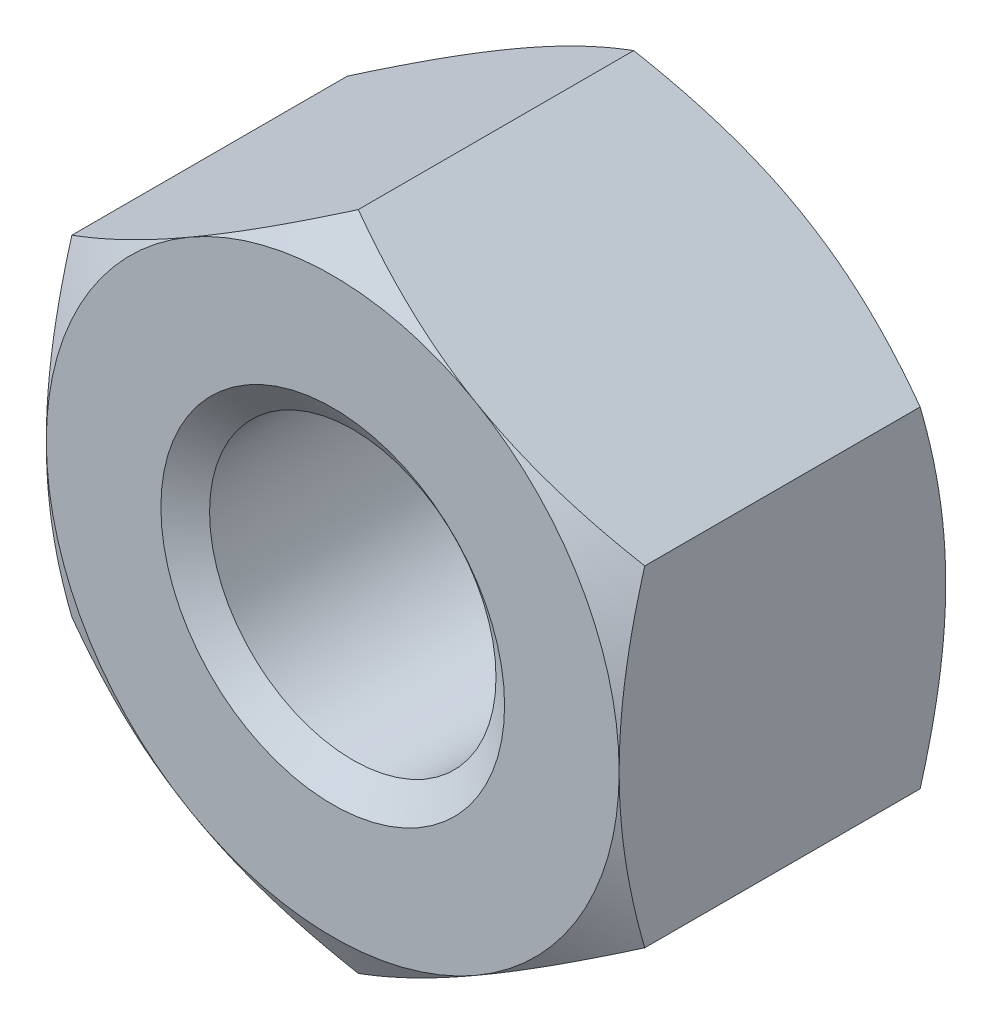
ISO-10303-21;
HEADER;
FILE_DESCRIPTION(('STEP AP214'),'2;1');
FILE_NAME('part.step','',(''),(''),'','','');
FILE_SCHEMA(('AUTOMOTIVE_DESIGN { 1 0 10303 214 1 1 1 1 }'));
ENDSEC;
DATA;
#1=APPLICATION_CONTEXT('core data for automotive mechanical design processes');
#2=APPLICATION_PROTOCOL_DEFINITION('international standard','automotive_design',2000,#1);
#3=PRODUCT_CONTEXT('',#1,'mechanical');
#4=PRODUCT('Part','Part','',(#3));
#5=PRODUCT_RELATED_PRODUCT_CATEGORY('part','',(#4));
#6=PRODUCT_DEFINITION_FORMATION('','',#4);
#7=PRODUCT_DEFINITION_CONTEXT('part definition',#1,'design');
#8=PRODUCT_DEFINITION('design','',#6,#7);
#9=PRODUCT_DEFINITION_SHAPE('','',#8);
#10=(LENGTH_UNIT() NAMED_UNIT(*) SI_UNIT(.MILLI.,.METRE.));
#11=(NAMED_UNIT(*) PLANE_ANGLE_UNIT() SI_UNIT($,.RADIAN.));
#12=(NAMED_UNIT(*) SI_UNIT($,.STERADIAN.) SOLID_ANGLE_UNIT());
#13=UNCERTAINTY_MEASURE_WITH_UNIT(LENGTH_MEASURE(1.E-05),#10,'distance_accuracy_value','');
#14=(GEOMETRIC_REPRESENTATION_CONTEXT(3) GLOBAL_UNCERTAINTY_ASSIGNED_CONTEXT((#13)) GLOBAL_UNIT_ASSIGNED_CONTEXT((#10,
#11,#12)) REPRESENTATION_CONTEXT('',''));
#15=CARTESIAN_POINT('',(0.,0.,0.));
#16=DIRECTION('',(0.,0.,1.));
#17=DIRECTION('',(1.,0.,0.));
#18=AXIS2_PLACEMENT_3D('',#15,#16,#17);
#19=CARTESIAN_POINT('',(0.,0.,-5.7));
#20=DIRECTION('',(0.,0.,1.));
#21=DIRECTION('',(1.,0.,0.));
#22=AXIS2_PLACEMENT_3D('',#19,#20,#21);
#23=CYLINDRICAL_SURFACE('',#22,2.5);
#24=CARTESIAN_POINT('',(0.,0.,-0.350103769104856));
#25=DIRECTION('',(0.,0.,1.));
#26=DIRECTION('',(1.,0.,0.));
#27=AXIS2_PLACEMENT_3D('',#24,#25,#26);
#28=CIRCLE('',#27,2.5);
#29=CARTESIAN_POINT('',(2.5,0.,-0.350103769104856));
#30=VERTEX_POINT('',#29);
#31=EDGE_CURVE('E195',#30,#30,#28,.F.);
#32=ORIENTED_EDGE('',*,*,#31,.F.);
#33=EDGE_LOOP('',(#32));
#34=FACE_BOUND('',#33,.T.);
#35=CARTESIAN_POINT('',(0.,0.,-5.32449623089515));
#36=DIRECTION('',(0.,0.,-1.));
#37=DIRECTION('',(-1.,0.,0.));
#38=AXIS2_PLACEMENT_3D('',#35,#36,#37);
#39=CIRCLE('',#38,2.5);
#40=CARTESIAN_POINT('',(-2.5,0.,-5.32449623089515));
#41=VERTEX_POINT('',#40);
#42=EDGE_CURVE('E48',#41,#41,#39,.F.);
#43=ORIENTED_EDGE('',*,*,#42,.F.);
#44=EDGE_LOOP('',(#43));
#45=FACE_BOUND('',#44,.T.);
#46=ADVANCED_FACE('F43',(#34,#45),#23,.F.);
#47=CARTESIAN_POINT('',(0.,5.77350269189626,-5.7));
#48=DIRECTION('',(-0.500000000000001,0.866025403784438,0.));
#49=DIRECTION('',(-0.866025403784438,-0.500000000000001,0.));
#50=AXIS2_PLACEMENT_3D('',#47,#48,#49);
#51=PLANE('',#50);
#52=DIRECTION('',(0.,0.,1.));
#53=VECTOR('',#52,1.);
#54=CARTESIAN_POINT('',(-5.,2.88675134594813,-5.7));
#55=LINE('',#54,#53);
#56=CARTESIAN_POINT('',(-5.,2.88675134594813,-5.25341801261479));
#57=VERTEX_POINT('',#56);
#58=CARTESIAN_POINT('',(-5.,2.88675134594813,-0.446581987385206));
#59=VERTEX_POINT('',#58);
#60=EDGE_CURVE('E182',#57,#59,#55,.T.);
#61=ORIENTED_EDGE('',*,*,#60,.T.);
#62=CARTESIAN_POINT('',(-5.0002,2.88663587589429,-0.446648656051833));
#63=CARTESIAN_POINT('',(-4.78046540547481,3.01349970319368,-0.373386567637638));
#64=CARTESIAN_POINT('',(-4.55885141554042,3.14144859993849,-0.306751321918094));
#65=CARTESIAN_POINT('',(-4.11178600454649,3.39956193532121,-0.190438991010812));
#66=CARTESIAN_POINT('',(-3.88632664040922,3.52973095989718,-0.14080304991579));
#67=CARTESIAN_POINT('',(-3.43816769477649,3.78847564779798,-0.063551025418698));
#68=CARTESIAN_POINT('',(-3.2155379068958,3.91701101576052,-0.0354203782834891));
#69=CARTESIAN_POINT('',(-2.88081009815336,4.11026620624323,-0.010194921953684));
#70=CARTESIAN_POINT('',(-2.76915780319494,4.17472868879311,-0.00461345976948346));
#71=CARTESIAN_POINT('',(-2.5457500293262,4.30371322717528,0.000797783248530087));
#72=CARTESIAN_POINT('',(-2.43399455370968,4.36823528110589,0.000627741741796707));
#73=CARTESIAN_POINT('',(-2.12781576914936,4.54500768479195,-0.00775363179203704));
#74=CARTESIAN_POINT('',(-1.93349391403278,4.65719946015293,-0.0218297718972524));
#75=CARTESIAN_POINT('',(-1.54613989800229,4.88083840557982,-0.0664652571094324));
#76=CARTESIAN_POINT('',(-1.35310909862843,4.9922847895602,-0.09703986014751));
#77=CARTESIAN_POINT('',(-0.964974657525145,5.21637431361295,-0.173468493621167));
#78=CARTESIAN_POINT('',(-0.769920001358263,5.32898917185759,-0.219646378878684));
#79=CARTESIAN_POINT('',(-0.382719654641231,5.55253939626498,-0.324451794491939));
#80=CARTESIAN_POINT('',(-0.190569004591913,5.66347762579592,-0.38305470343738));
#81=CARTESIAN_POINT('',(0.000199999999999958,5.7736181619501,-0.446648656051835));
#82=B_SPLINE_CURVE_WITH_KNOTS('',3,(#62,#63,#64,#65,#66,#67,#68,#69,#70,#71,#72,#73,#74,#75,#76,
#77,#78,#79,#80,#81),.UNSPECIFIED.,.F.,.F.,(4,2,2,2,2,2,2,2,2,4),(0.,0.792555841363092,
1.58701660053334,2.36181537487281,2.74884076077326,3.13585419177295,3.8096236259968,
4.4840172390119,5.17336882348929,5.86136694793726),.UNSPECIFIED.);
#83=CARTESIAN_POINT('',(-2.5,4.33012701892219,0.));
#84=VERTEX_POINT('',#83);
#85=EDGE_CURVE('E71',#59,#84,#82,.T.);
#86=ORIENTED_EDGE('',*,*,#85,.T.);
#87=CARTESIAN_POINT('',(0.,5.77350269189626,-0.446581987385208));
#88=VERTEX_POINT('',#87);
#89=EDGE_CURVE('E272',#84,#88,#82,.T.);
#90=ORIENTED_EDGE('',*,*,#89,.T.);
#91=DIRECTION('',(0.,0.,1.));
#92=VECTOR('',#91,1.);
#93=CARTESIAN_POINT('',(0.,5.77350269189626,-5.7));
#94=LINE('',#93,#92);
#95=CARTESIAN_POINT('',(0.,5.77350269189626,-5.25341801261479));
#96=VERTEX_POINT('',#95);
#97=EDGE_CURVE('E163',#96,#88,#94,.T.);
#98=ORIENTED_EDGE('',*,*,#97,.F.);
#99=CARTESIAN_POINT('',(-5.0002,2.88663587589429,-5.25335134394817));
#100=CARTESIAN_POINT('',(-4.78046540547481,3.01349970319368,-5.32661343236236));
#101=CARTESIAN_POINT('',(-4.55885141554042,3.14144859993849,-5.39324867808191));
#102=CARTESIAN_POINT('',(-4.11178600454649,3.39956193532121,-5.50956100898919));
#103=CARTESIAN_POINT('',(-3.88632664040922,3.52973095989718,-5.55919695008421));
#104=CARTESIAN_POINT('',(-3.43816769477649,3.78847564779798,-5.6364489745813));
#105=CARTESIAN_POINT('',(-3.2155379068958,3.91701101576052,-5.66457962171651));
#106=CARTESIAN_POINT('',(-2.88081009815336,4.11026620624323,-5.68980507804632));
#107=CARTESIAN_POINT('',(-2.76915780319494,4.17472868879311,-5.69538654023052));
#108=CARTESIAN_POINT('',(-2.5457500293262,4.30371322717528,-5.70079778324853));
#109=CARTESIAN_POINT('',(-2.43399455370968,4.36823528110589,-5.7006277417418));
#110=CARTESIAN_POINT('',(-2.12781576914936,4.54500768479195,-5.69224636820796));
#111=CARTESIAN_POINT('',(-1.93349391403278,4.65719946015293,-5.67817022810275));
#112=CARTESIAN_POINT('',(-1.54613989800229,4.88083840557982,-5.63353474289057));
#113=CARTESIAN_POINT('',(-1.35310909862843,4.99228478956021,-5.60296013985249));
#114=CARTESIAN_POINT('',(-0.964974657525143,5.21637431361295,-5.52653150637883));
#115=CARTESIAN_POINT('',(-0.769920001358262,5.32898917185759,-5.48035362112132));
#116=CARTESIAN_POINT('',(-0.38271965464123,5.55253939626498,-5.37554820550806));
#117=CARTESIAN_POINT('',(-0.190569004591913,5.66347762579592,-5.31694529656262));
#118=CARTESIAN_POINT('',(0.000199999999999976,5.7736181619501,-5.25335134394817));
#119=B_SPLINE_CURVE_WITH_KNOTS('',3,(#99,#100,#101,#102,#103,#104,#105,#106,#107,#108,#109,#110,
#111,#112,#113,#114,#115,#116,#117,#118),.UNSPECIFIED.,.F.,.F.,(4,2,2,2,2,2,2,2,2,4),(0.,
0.792555841363092,1.58701660053334,2.36181537487281,2.74884076077326,3.13585419177295,
3.8096236259968,4.4840172390119,5.17336882348929,5.86136694793726),.UNSPECIFIED.);
#120=CARTESIAN_POINT('',(-2.5,4.33012701892219,-5.7));
#121=VERTEX_POINT('',#120);
#122=EDGE_CURVE('E186',#121,#96,#119,.T.);
#123=ORIENTED_EDGE('',*,*,#122,.F.);
#124=EDGE_CURVE('E296',#57,#121,#119,.T.);
#125=ORIENTED_EDGE('',*,*,#124,.F.);
#126=EDGE_LOOP('',(#61,#86,#90,#98,#123,#125));
#127=FACE_BOUND('',#126,.T.);
#128=ADVANCED_FACE('F45',(#127),#51,.T.);
#129=CARTESIAN_POINT('',(5.,2.88675134594813,-5.7));
#130=DIRECTION('',(0.500000000000001,0.866025403784438,0.));
#131=DIRECTION('',(-0.866025403784438,0.500000000000001,0.));
#132=AXIS2_PLACEMENT_3D('',#129,#130,#131);
#133=PLANE('',#132);
#134=ORIENTED_EDGE('',*,*,#97,.T.);
#135=CARTESIAN_POINT('',(-0.000199999999999704,5.7736181619501,-0.446648656051834));
#136=CARTESIAN_POINT('',(0.219534594525186,5.64675433465071,-0.373386567637639));
#137=CARTESIAN_POINT('',(0.441148584459582,5.5188054379059,-0.306751321918096));
#138=CARTESIAN_POINT('',(0.888213995453515,5.26069210252318,-0.190438991010813));
#139=CARTESIAN_POINT('',(1.11367335959078,5.13052307794721,-0.140803049915791));
#140=CARTESIAN_POINT('',(1.56183230522351,4.87177839004641,-0.0635510254186986));
#141=CARTESIAN_POINT('',(1.7844620931042,4.74324302208387,-0.0354203782834896));
#142=CARTESIAN_POINT('',(2.11918990184665,4.54998783160116,-0.0101949219536843));
#143=CARTESIAN_POINT('',(2.23084219680506,4.48552534905128,-0.0046134597694837));
#144=CARTESIAN_POINT('',(2.4542499706738,4.35654081066911,0.000797783248529829));
#145=CARTESIAN_POINT('',(2.56600544629032,4.2920187567385,0.000627741741796377));
#146=CARTESIAN_POINT('',(2.87218423085064,4.11524635305244,-0.00775363179203714));
#147=CARTESIAN_POINT('',(3.06650608596722,4.00305457769146,-0.0218297718972519));
#148=CARTESIAN_POINT('',(3.45386010199771,3.77941563226457,-0.0664652571094313));
#149=CARTESIAN_POINT('',(3.64689090137157,3.66796924828418,-0.097039860147509));
#150=CARTESIAN_POINT('',(4.03502534247485,3.44387972423144,-0.173468493621165));
#151=CARTESIAN_POINT('',(4.23007999864174,3.3312648659868,-0.219646378878682));
#152=CARTESIAN_POINT('',(4.61728034535877,3.1077146415794,-0.324451794491936));
#153=CARTESIAN_POINT('',(4.80943099540809,2.99677641204847,-0.383054703437377));
#154=CARTESIAN_POINT('',(5.0002,2.88663587589429,-0.446648656051833));
#155=B_SPLINE_CURVE_WITH_KNOTS('',3,(#135,#136,#137,#138,#139,#140,#141,#142,#143,#144,#145,
#146,#147,#148,#149,#150,#151,#152,#153,#154),.UNSPECIFIED.,.F.,.F.,(4,2,2,2,2,2,2,2,2,4),(0.,
0.792555841363093,1.58701660053334,2.36181537487281,2.74884076077326,3.13585419177296,
3.8096236259968,4.4840172390119,5.17336882348929,5.86136694793726),.UNSPECIFIED.);
#156=CARTESIAN_POINT('',(2.5,4.33012701892219,0.));
#157=VERTEX_POINT('',#156);
#158=EDGE_CURVE('E154',#88,#157,#155,.T.);
#159=ORIENTED_EDGE('',*,*,#158,.T.);
#160=CARTESIAN_POINT('',(5.,2.88675134594813,-0.446581987385208));
#161=VERTEX_POINT('',#160);
#162=EDGE_CURVE('E139',#157,#161,#155,.T.);
#163=ORIENTED_EDGE('',*,*,#162,.T.);
#164=DIRECTION('',(0.,0.,1.));
#165=VECTOR('',#164,1.);
#166=CARTESIAN_POINT('',(5.,2.88675134594813,-5.7));
#167=LINE('',#166,#165);
#168=CARTESIAN_POINT('',(5.,2.88675134594813,-5.25341801261479));
#169=VERTEX_POINT('',#168);
#170=EDGE_CURVE('E153',#169,#161,#167,.T.);
#171=ORIENTED_EDGE('',*,*,#170,.F.);
#172=CARTESIAN_POINT('',(-0.000199999999999913,5.7736181619501,-5.25335134394817));
#173=CARTESIAN_POINT('',(0.219534594525185,5.64675433465071,-5.32661343236236));
#174=CARTESIAN_POINT('',(0.441148584459581,5.5188054379059,-5.3932486780819));
#175=CARTESIAN_POINT('',(0.888213995453515,5.26069210252318,-5.50956100898919));
#176=CARTESIAN_POINT('',(1.11367335959078,5.13052307794721,-5.55919695008421));
#177=CARTESIAN_POINT('',(1.56183230522351,4.87177839004641,-5.6364489745813));
#178=CARTESIAN_POINT('',(1.7844620931042,4.74324302208387,-5.66457962171651));
#179=CARTESIAN_POINT('',(2.11918990184664,4.54998783160116,-5.68980507804632));
#180=CARTESIAN_POINT('',(2.23084219680506,4.48552534905128,-5.69538654023052));
#181=CARTESIAN_POINT('',(2.4542499706738,4.35654081066911,-5.70079778324853));
#182=CARTESIAN_POINT('',(2.56600544629032,4.2920187567385,-5.7006277417418));
#183=CARTESIAN_POINT('',(2.87218423085064,4.11524635305244,-5.69224636820796));
#184=CARTESIAN_POINT('',(3.06650608596722,4.00305457769146,-5.67817022810275));
#185=CARTESIAN_POINT('',(3.45386010199771,3.77941563226457,-5.63353474289057));
#186=CARTESIAN_POINT('',(3.64689090137157,3.66796924828418,-5.60296013985249));
#187=CARTESIAN_POINT('',(4.03502534247485,3.44387972423144,-5.52653150637884));
#188=CARTESIAN_POINT('',(4.23007999864174,3.3312648659868,-5.48035362112132));
#189=CARTESIAN_POINT('',(4.61728034535877,3.1077146415794,-5.37554820550806));
#190=CARTESIAN_POINT('',(4.80943099540809,2.99677641204847,-5.31694529656262));
#191=CARTESIAN_POINT('',(5.0002,2.88663587589429,-5.25335134394817));
#192=B_SPLINE_CURVE_WITH_KNOTS('',3,(#172,#173,#174,#175,#176,#177,#178,#179,#180,#181,#182,
#183,#184,#185,#186,#187,#188,#189,#190,#191),.UNSPECIFIED.,.F.,.F.,(4,2,2,2,2,2,2,2,2,4),(0.,
0.792555841363092,1.58701660053334,2.36181537487281,2.74884076077326,3.13585419177296,
3.8096236259968,4.4840172390119,5.17336882348929,5.86136694793725),.UNSPECIFIED.);
#193=CARTESIAN_POINT('',(2.5,4.33012701892219,-5.7));
#194=VERTEX_POINT('',#193);
#195=EDGE_CURVE('E288',#194,#169,#192,.T.);
#196=ORIENTED_EDGE('',*,*,#195,.F.);
#197=EDGE_CURVE('E295',#96,#194,#192,.T.);
#198=ORIENTED_EDGE('',*,*,#197,.F.);
#199=EDGE_LOOP('',(#134,#159,#163,#171,#196,#198));
#200=FACE_BOUND('',#199,.T.);
#201=ADVANCED_FACE('F151',(#200),#133,.T.);
#202=CARTESIAN_POINT('',(5.,2.88675134594813,-5.7));
#203=DIRECTION('',(-1.,0.,0.));
#204=DIRECTION('',(0.,0.,1.));
#205=AXIS2_PLACEMENT_3D('',#202,#203,#204);
#206=PLANE('',#205);
#207=CARTESIAN_POINT('',(5.,-7.65608998744865,-2.39263352655081));
#208=CARTESIAN_POINT('',(5.,-7.43656171400166,-2.28654533817208));
#209=CARTESIAN_POINT('',(5.,-7.21651440170022,-2.18151175461596));
#210=CARTESIAN_POINT('',(5.,-6.77510105921518,-1.97415643363977));
#211=CARTESIAN_POINT('',(5.,-6.55373480873053,-1.87183516574569));
#212=CARTESIAN_POINT('',(5.,-6.10820714710357,-1.66996807853492));
#213=CARTESIAN_POINT('',(5.,-5.88403698971125,-1.57044149281731));
#214=CARTESIAN_POINT('',(5.,-5.43385418074677,-1.37566323278682));
#215=CARTESIAN_POINT('',(5.,-5.20784162594278,-1.28041133564244));
#216=CARTESIAN_POINT('',(5.,-4.75080884782756,-1.09418830918942));
#217=CARTESIAN_POINT('',(5.,-4.51976121099505,-1.0032840909987));
#218=CARTESIAN_POINT('',(5.,-4.054940534221,-0.828595302971953));
#219=CARTESIAN_POINT('',(5.,-3.82116719434025,-0.744811525247655));
#220=CARTESIAN_POINT('',(5.,-3.35100416711889,-0.586614632364622));
#221=CARTESIAN_POINT('',(5.,-3.11462125088188,-0.512181595225273));
#222=CARTESIAN_POINT('',(5.,-2.63849247870023,-0.375104393872378));
#223=CARTESIAN_POINT('',(5.,-2.3987477121033,-0.31245650159695));
#224=CARTESIAN_POINT('',(5.,-1.91574303714497,-0.201987753994869));
#225=CARTESIAN_POINT('',(5.,-1.672482210841,-0.154170846558642));
#226=CARTESIAN_POINT('',(5.,-1.18299359688664,-0.0765955557924025));
#227=CARTESIAN_POINT('',(5.,-0.936765806613279,-0.0468371884284092));
#228=CARTESIAN_POINT('',(5.,-0.567032279323845,-0.0176512015862963));
#229=CARTESIAN_POINT('',(5.,-0.444105297658536,-0.0104963190599468));
#230=CARTESIAN_POINT('',(5.,-0.198053005238562,-0.00139545226904069));
#231=CARTESIAN_POINT('',(5.,-0.074927697080225,0.000550599639614518));
#232=CARTESIAN_POINT('',(5.,0.171257999892357,-0.000818470345663901));
#233=CARTESIAN_POINT('',(5.,0.294318397227091,-0.00413211431301121));
#234=CARTESIAN_POINT('',(5.,0.540192730788843,-0.0159365972827597));
#235=CARTESIAN_POINT('',(5.,0.663006654263487,-0.0244276975701649));
#236=CARTESIAN_POINT('',(5.,0.960681872881669,-0.0511063802753013));
#237=CARTESIAN_POINT('',(5.,1.1353143627994,-0.0718889676982869));
#238=CARTESIAN_POINT('',(5.,1.48321675799389,-0.122765655722696));
#239=CARTESIAN_POINT('',(5.,1.65648647841236,-0.152860997990034));
#240=CARTESIAN_POINT('',(5.,2.00155426058699,-0.221298792011551));
#241=CARTESIAN_POINT('',(5.,2.17335067370373,-0.259649477486405));
#242=CARTESIAN_POINT('',(5.,2.51518168221054,-0.343428305385011));
#243=CARTESIAN_POINT('',(5.,2.6852163841931,-0.388856016914002));
#244=CARTESIAN_POINT('',(5.,3.02770318928891,-0.486887782054292));
#245=CARTESIAN_POINT('',(5.,3.20011248435311,-0.539640363823942));
#246=CARTESIAN_POINT('',(5.,3.54310870430176,-0.650357787302626));
#247=CARTESIAN_POINT('',(5.,3.71369679659714,-0.70831903390707));
#248=CARTESIAN_POINT('',(5.,4.05236610267973,-0.828256540728473));
#249=CARTESIAN_POINT('',(5.,4.22045602230055,-0.890208365426364));
#250=CARTESIAN_POINT('',(5.,4.55533171687447,-1.01774823413812));
#251=CARTESIAN_POINT('',(5.,4.72211693321414,-1.08333774778777));
#252=CARTESIAN_POINT('',(5.,4.88829623733354,-1.15038625817724));
#253=B_SPLINE_CURVE_WITH_KNOTS('',3,(#207,#208,#209,#210,#211,#212,#213,#214,#215,#216,#217,
#218,#219,#220,#221,#222,#223,#224,#225,#226,#227,#228,#229,#230,#231,#232,#233,#234,#235,#236,
#237,#238,#239,#240,#241,#242,#243,#244,#245,#246,#247,#248,#249,#250,#251,#252),.UNSPECIFIED.,
.F.,.F.,(4,2,2,2,2,2,2,2,2,2,2,2,2,2,2,2,2,2,2,2,2,2,4),(0.,0.731464740665351,1.46305528824908,
2.19883243307486,2.93457117856034,3.67934251246858,4.42419659013361,5.1674358087199,
5.91043951739339,6.65364083834807,7.39684281638516,7.76615414335457,8.13546067426611,
8.50466345177856,8.87388486298453,9.40118542949727,9.92855633110015,10.4564556797854,
10.9843228991235,11.525120280828,12.065547221064,12.6029322754131,13.1405360390026),.UNSPECIFIED.);
#254=CARTESIAN_POINT('',(5.,-2.88675134594813,-0.446581987385208));
#255=VERTEX_POINT('',#254);
#256=CARTESIAN_POINT('',(5.,0.,0.));
#257=VERTEX_POINT('',#256);
#258=EDGE_CURVE('E146',#255,#257,#253,.T.);
#259=ORIENTED_EDGE('',*,*,#258,.F.);
#260=DIRECTION('',(0.,0.,1.));
#261=VECTOR('',#260,1.);
#262=CARTESIAN_POINT('',(5.,-2.88675134594813,-5.7));
#263=LINE('',#262,#261);
#264=CARTESIAN_POINT('',(5.,-2.88675134594813,-5.25341801261479));
#265=VERTEX_POINT('',#264);
#266=EDGE_CURVE('E164',#265,#255,#263,.T.);
#267=ORIENTED_EDGE('',*,*,#266,.F.);
#268=CARTESIAN_POINT('',(5.,-7.65608998744865,-3.30736647344919));
#269=CARTESIAN_POINT('',(5.,-7.43656171400166,-3.41345466182792));
#270=CARTESIAN_POINT('',(5.,-7.21651440170022,-3.51848824538404));
#271=CARTESIAN_POINT('',(5.,-6.77510105921518,-3.72584356636023));
#272=CARTESIAN_POINT('',(5.,-6.55373480873053,-3.82816483425431));
#273=CARTESIAN_POINT('',(5.,-6.10820714710357,-4.03003192146508));
#274=CARTESIAN_POINT('',(5.,-5.88403698971125,-4.12955850718269));
#275=CARTESIAN_POINT('',(5.,-5.43385418074677,-4.32433676721318));
#276=CARTESIAN_POINT('',(5.,-5.20784162594278,-4.41958866435756));
#277=CARTESIAN_POINT('',(5.,-4.75080884782756,-4.60581169081058));
#278=CARTESIAN_POINT('',(5.,-4.51976121099505,-4.6967159090013));
#279=CARTESIAN_POINT('',(5.,-4.054940534221,-4.87140469702805));
#280=CARTESIAN_POINT('',(5.,-3.82116719434025,-4.95518847475234));
#281=CARTESIAN_POINT('',(5.,-3.35100416711889,-5.11338536763538));
#282=CARTESIAN_POINT('',(5.,-3.11462125088188,-5.18781840477473));
#283=CARTESIAN_POINT('',(5.,-2.63849247870023,-5.32489560612762));
#284=CARTESIAN_POINT('',(5.,-2.3987477121033,-5.38754349840305));
#285=CARTESIAN_POINT('',(5.,-1.91574303714497,-5.49801224600513));
#286=CARTESIAN_POINT('',(5.,-1.672482210841,-5.54582915344136));
#287=CARTESIAN_POINT('',(5.,-1.18299359688664,-5.6234044442076));
#288=CARTESIAN_POINT('',(5.,-0.936765806613279,-5.65316281157159));
#289=CARTESIAN_POINT('',(5.,-0.567032279323844,-5.6823487984137));
#290=CARTESIAN_POINT('',(5.,-0.444105297658536,-5.68950368094005));
#291=CARTESIAN_POINT('',(5.,-0.198053005238561,-5.69860454773096));
#292=CARTESIAN_POINT('',(5.,-0.0749276970802249,-5.70055059963962));
#293=CARTESIAN_POINT('',(5.,0.171257999892357,-5.69918152965434));
#294=CARTESIAN_POINT('',(5.,0.294318397227092,-5.69586788568699));
#295=CARTESIAN_POINT('',(5.,0.540192730788844,-5.68406340271724));
#296=CARTESIAN_POINT('',(5.,0.663006654263487,-5.67557230242983));
#297=CARTESIAN_POINT('',(5.,0.960681872881669,-5.6488936197247));
#298=CARTESIAN_POINT('',(5.,1.1353143627994,-5.62811103230171));
#299=CARTESIAN_POINT('',(5.,1.48321675799389,-5.5772343442773));
#300=CARTESIAN_POINT('',(5.,1.65648647841236,-5.54713900200997));
#301=CARTESIAN_POINT('',(5.,2.00155426058699,-5.47870120798845));
#302=CARTESIAN_POINT('',(5.,2.17335067370373,-5.44035052251359));
#303=CARTESIAN_POINT('',(5.,2.51518168221054,-5.35657169461499));
#304=CARTESIAN_POINT('',(5.,2.6852163841931,-5.311143983086));
#305=CARTESIAN_POINT('',(5.,3.02770318928891,-5.21311221794571));
#306=CARTESIAN_POINT('',(5.,3.20011248435311,-5.16035963617606));
#307=CARTESIAN_POINT('',(5.,3.54310870430176,-5.04964221269737));
#308=CARTESIAN_POINT('',(5.,3.71369679659714,-4.99168096609293));
#309=CARTESIAN_POINT('',(5.,4.05236610267973,-4.87174345927153));
#310=CARTESIAN_POINT('',(5.,4.22045602230055,-4.80979163457364));
#311=CARTESIAN_POINT('',(5.,4.55533171687447,-4.68225176586188));
#312=CARTESIAN_POINT('',(5.,4.72211693321414,-4.61666225221223));
#313=CARTESIAN_POINT('',(5.,4.88829623733355,-4.54961374182276));
#314=B_SPLINE_CURVE_WITH_KNOTS('',3,(#268,#269,#270,#271,#272,#273,#274,#275,#276,#277,#278,
#279,#280,#281,#282,#283,#284,#285,#286,#287,#288,#289,#290,#291,#292,#293,#294,#295,#296,#297,
#298,#299,#300,#301,#302,#303,#304,#305,#306,#307,#308,#309,#310,#311,#312,#313),.UNSPECIFIED.,
.F.,.F.,(4,2,2,2,2,2,2,2,2,2,2,2,2,2,2,2,2,2,2,2,2,2,4),(0.,0.731464740665351,1.46305528824908,
2.19883243307486,2.93457117856033,3.67934251246858,4.42419659013361,5.1674358087199,
5.91043951739339,6.65364083834807,7.39684281638516,7.76615414335457,8.13546067426611,
8.50466345177857,8.87388486298453,9.40118542949727,9.92855633110015,10.4564556797854,
10.9843228991235,11.525120280828,12.065547221064,12.6029322754131,13.1405360390026),.UNSPECIFIED.);
#315=CARTESIAN_POINT('',(5.,0.,-5.7));
#316=VERTEX_POINT('',#315);
#317=EDGE_CURVE('E303',#265,#316,#314,.T.);
#318=ORIENTED_EDGE('',*,*,#317,.T.);
#319=EDGE_CURVE('E161',#316,#169,#314,.T.);
#320=ORIENTED_EDGE('',*,*,#319,.T.);
#321=ORIENTED_EDGE('',*,*,#170,.T.);
#322=EDGE_CURVE('E136',#257,#161,#253,.T.);
#323=ORIENTED_EDGE('',*,*,#322,.F.);
#324=EDGE_LOOP('',(#259,#267,#318,#320,#321,#323));
#325=FACE_BOUND('',#324,.T.);
#326=ADVANCED_FACE('F158',(#325),#206,.F.);
#327=CARTESIAN_POINT('',(0.,-5.77350269189627,-5.7));
#328=DIRECTION('',(0.500000000000001,-0.866025403784438,0.));
#329=DIRECTION('',(0.866025403784438,0.500000000000001,0.));
#330=AXIS2_PLACEMENT_3D('',#327,#328,#329);
#331=PLANE('',#330);
#332=ORIENTED_EDGE('',*,*,#266,.T.);
#333=CARTESIAN_POINT('',(5.0002,-2.88663587589429,-0.446648656051834));
#334=CARTESIAN_POINT('',(4.78046540547481,-3.01349970319368,-0.373386567637639));
#335=CARTESIAN_POINT('',(4.55885141554042,-3.14144859993849,-0.306751321918095));
#336=CARTESIAN_POINT('',(4.11178600454648,-3.39956193532121,-0.190438991010814));
#337=CARTESIAN_POINT('',(3.88632664040922,-3.52973095989718,-0.140803049915792));
#338=CARTESIAN_POINT('',(3.43816769477649,-3.78847564779798,-0.0635510254187001));
#339=CARTESIAN_POINT('',(3.2155379068958,-3.91701101576052,-0.0354203782834911));
#340=CARTESIAN_POINT('',(2.88081009815335,-4.11026620624323,-0.0101949219536866));
#341=CARTESIAN_POINT('',(2.76915780319493,-4.17472868879311,-0.00461345976948629));
#342=CARTESIAN_POINT('',(2.5457500293262,-4.30371322717528,0.000797783248527157));
#343=CARTESIAN_POINT('',(2.43399455370968,-4.3682352811059,0.000627741741793945));
#344=CARTESIAN_POINT('',(2.12781576914936,-4.54500768479195,-0.00775363179203978));
#345=CARTESIAN_POINT('',(1.93349391403278,-4.65719946015293,-0.0218297718972556));
#346=CARTESIAN_POINT('',(1.54613989800229,-4.88083840557982,-0.0664652571094359));
#347=CARTESIAN_POINT('',(1.35310909862843,-4.99228478956021,-0.0970398601475132));
#348=CARTESIAN_POINT('',(0.964974657525143,-5.21637431361296,-0.17346849362117));
#349=CARTESIAN_POINT('',(0.769920001358262,-5.32898917185759,-0.219646378878687));
#350=CARTESIAN_POINT('',(0.382719654641231,-5.55253939626499,-0.324451794491942));
#351=CARTESIAN_POINT('',(0.190569004591914,-5.66347762579593,-0.383054703437383));
#352=CARTESIAN_POINT('',(-0.000199999999999648,-5.7736181619501,-0.446648656051838));
#353=B_SPLINE_CURVE_WITH_KNOTS('',3,(#333,#334,#335,#336,#337,#338,#339,#340,#341,#342,#343,
#344,#345,#346,#347,#348,#349,#350,#351,#352),.UNSPECIFIED.,.F.,.F.,(4,2,2,2,2,2,2,2,2,4),(0.,
0.792555841363093,1.58701660053334,2.36181537487281,2.74884076077326,3.13585419177296,
3.8096236259968,4.4840172390119,5.17336882348929,5.86136694793726),.UNSPECIFIED.);
#354=CARTESIAN_POINT('',(2.5,-4.33012701892219,0.));
#355=VERTEX_POINT('',#354);
#356=EDGE_CURVE('E386',#255,#355,#353,.T.);
#357=ORIENTED_EDGE('',*,*,#356,.T.);
#358=CARTESIAN_POINT('',(0.,-5.77350269189626,-0.446581987385208));
#359=VERTEX_POINT('',#358);
#360=EDGE_CURVE('E255',#355,#359,#353,.T.);
#361=ORIENTED_EDGE('',*,*,#360,.T.);
#362=DIRECTION('',(0.,0.,1.));
#363=VECTOR('',#362,1.);
#364=CARTESIAN_POINT('',(0.,-5.77350269189627,-5.7));
#365=LINE('',#364,#363);
#366=CARTESIAN_POINT('',(0.,-5.77350269189626,-5.25341801261479));
#367=VERTEX_POINT('',#366);
#368=EDGE_CURVE('E171',#367,#359,#365,.T.);
#369=ORIENTED_EDGE('',*,*,#368,.F.);
#370=CARTESIAN_POINT('',(5.0002,-2.88663587589429,-5.25335134394817));
#371=CARTESIAN_POINT('',(4.78046540547481,-3.01349970319368,-5.32661343236236));
#372=CARTESIAN_POINT('',(4.55885141554042,-3.14144859993849,-5.39324867808191));
#373=CARTESIAN_POINT('',(4.11178600454648,-3.39956193532121,-5.50956100898919));
#374=CARTESIAN_POINT('',(3.88632664040922,-3.52973095989718,-5.55919695008421));
#375=CARTESIAN_POINT('',(3.43816769477649,-3.78847564779798,-5.6364489745813));
#376=CARTESIAN_POINT('',(3.2155379068958,-3.91701101576052,-5.66457962171651));
#377=CARTESIAN_POINT('',(2.88081009815335,-4.11026620624323,-5.68980507804631));
#378=CARTESIAN_POINT('',(2.76915780319494,-4.17472868879311,-5.69538654023051));
#379=CARTESIAN_POINT('',(2.5457500293262,-4.30371322717528,-5.70079778324853));
#380=CARTESIAN_POINT('',(2.43399455370968,-4.3682352811059,-5.70062774174179));
#381=CARTESIAN_POINT('',(2.12781576914936,-4.54500768479195,-5.69224636820796));
#382=CARTESIAN_POINT('',(1.93349391403278,-4.65719946015293,-5.67817022810274));
#383=CARTESIAN_POINT('',(1.54613989800229,-4.88083840557982,-5.63353474289056));
#384=CARTESIAN_POINT('',(1.35310909862843,-4.99228478956021,-5.60296013985249));
#385=CARTESIAN_POINT('',(0.964974657525144,-5.21637431361296,-5.52653150637883));
#386=CARTESIAN_POINT('',(0.769920001358263,-5.32898917185759,-5.48035362112131));
#387=CARTESIAN_POINT('',(0.382719654641232,-5.55253939626499,-5.37554820550806));
#388=CARTESIAN_POINT('',(0.190569004591914,-5.66347762579593,-5.31694529656262));
#389=CARTESIAN_POINT('',(-0.000199999999999354,-5.7736181619501,-5.25335134394816));
#390=B_SPLINE_CURVE_WITH_KNOTS('',3,(#370,#371,#372,#373,#374,#375,#376,#377,#378,#379,#380,
#381,#382,#383,#384,#385,#386,#387,#388,#389),.UNSPECIFIED.,.F.,.F.,(4,2,2,2,2,2,2,2,2,4),(0.,
0.792555841363094,1.58701660053334,2.36181537487281,2.74884076077326,3.13585419177296,
3.8096236259968,4.4840172390119,5.17336882348929,5.86136694793726),.UNSPECIFIED.);
#391=CARTESIAN_POINT('',(2.5,-4.33012701892219,-5.7));
#392=VERTEX_POINT('',#391);
#393=EDGE_CURVE('E311',#392,#367,#390,.T.);
#394=ORIENTED_EDGE('',*,*,#393,.F.);
#395=EDGE_CURVE('E310',#265,#392,#390,.T.);
#396=ORIENTED_EDGE('',*,*,#395,.F.);
#397=EDGE_LOOP('',(#332,#357,#361,#369,#394,#396));
#398=FACE_BOUND('',#397,.T.);
#399=ADVANCED_FACE('F324',(#398),#331,.T.);
#400=CARTESIAN_POINT('',(-5.,-2.88675134594813,-5.7));
#401=DIRECTION('',(-0.500000000000001,-0.866025403784438,0.));
#402=DIRECTION('',(0.866025403784438,-0.500000000000001,0.));
#403=AXIS2_PLACEMENT_3D('',#400,#401,#402);
#404=PLANE('',#403);
#405=ORIENTED_EDGE('',*,*,#368,.T.);
#406=CARTESIAN_POINT('',(0.000200000000000199,-5.7736181619501,-0.446648656051837));
#407=CARTESIAN_POINT('',(-0.219534594525185,-5.64675433465072,-0.373386567637643));
#408=CARTESIAN_POINT('',(-0.441148584459581,-5.5188054379059,-0.3067513219181));
#409=CARTESIAN_POINT('',(-0.888213995453515,-5.26069210252319,-0.190438991010817));
#410=CARTESIAN_POINT('',(-1.11367335959078,-5.13052307794722,-0.140803049915794));
#411=CARTESIAN_POINT('',(-1.56183230522351,-4.87177839004641,-0.063551025418701));
#412=CARTESIAN_POINT('',(-1.7844620931042,-4.74324302208387,-0.0354203782834921));
#413=CARTESIAN_POINT('',(-2.11918990184665,-4.54998783160117,-0.0101949219536868));
#414=CARTESIAN_POINT('',(-2.23084219680507,-4.48552534905128,-0.00461345976948621));
#415=CARTESIAN_POINT('',(-2.4542499706738,-4.35654081066911,0.000797783248527581));
#416=CARTESIAN_POINT('',(-2.56600544629032,-4.2920187567385,0.000627741741794362));
#417=CARTESIAN_POINT('',(-2.87218423085065,-4.11524635305245,-0.0077536317920391));
#418=CARTESIAN_POINT('',(-3.06650608596722,-4.00305457769146,-0.0218297718972544));
#419=CARTESIAN_POINT('',(-3.45386010199771,-3.77941563226458,-0.0664652571094341));
#420=CARTESIAN_POINT('',(-3.64689090137157,-3.66796924828419,-0.0970398601475115));
#421=CARTESIAN_POINT('',(-4.03502534247486,-3.44387972423144,-0.173468493621168));
#422=CARTESIAN_POINT('',(-4.23007999864174,-3.3312648659868,-0.219646378878684));
#423=CARTESIAN_POINT('',(-4.61728034535877,-3.10771464157941,-0.324451794491939));
#424=CARTESIAN_POINT('',(-4.80943099540809,-2.99677641204847,-0.383054703437379));
#425=CARTESIAN_POINT('',(-5.0002,-2.88663587589429,-0.446648656051834));
#426=B_SPLINE_CURVE_WITH_KNOTS('',3,(#406,#407,#408,#409,#410,#411,#412,#413,#414,#415,#416,
#417,#418,#419,#420,#421,#422,#423,#424,#425),.UNSPECIFIED.,.F.,.F.,(4,2,2,2,2,2,2,2,2,4),(0.,
0.792555841363092,1.58701660053334,2.36181537487281,2.74884076077326,3.13585419177296,
3.8096236259968,4.4840172390119,5.17336882348929,5.86136694793726),.UNSPECIFIED.);
#427=CARTESIAN_POINT('',(-2.5,-4.33012701892219,0.));
#428=VERTEX_POINT('',#427);
#429=EDGE_CURVE('E390',#359,#428,#426,.T.);
#430=ORIENTED_EDGE('',*,*,#429,.T.);
#431=CARTESIAN_POINT('',(-5.,-2.88675134594813,-0.446581987385208));
#432=VERTEX_POINT('',#431);
#433=EDGE_CURVE('E227',#428,#432,#426,.T.);
#434=ORIENTED_EDGE('',*,*,#433,.T.);
#435=DIRECTION('',(0.,0.,1.));
#436=VECTOR('',#435,1.);
#437=CARTESIAN_POINT('',(-5.,-2.88675134594813,-5.7));
#438=LINE('',#437,#436);
#439=CARTESIAN_POINT('',(-5.,-2.88675134594813,-5.25341801261479));
#440=VERTEX_POINT('',#439);
#441=EDGE_CURVE('E178',#440,#432,#438,.T.);
#442=ORIENTED_EDGE('',*,*,#441,.F.);
#443=CARTESIAN_POINT('',(0.000200000000000199,-5.7736181619501,-5.25335134394816));
#444=CARTESIAN_POINT('',(-0.219534594525186,-5.64675433465072,-5.32661343236236));
#445=CARTESIAN_POINT('',(-0.441148584459581,-5.5188054379059,-5.3932486780819));
#446=CARTESIAN_POINT('',(-0.888213995453515,-5.26069210252319,-5.50956100898918));
#447=CARTESIAN_POINT('',(-1.11367335959078,-5.13052307794722,-5.55919695008421));
#448=CARTESIAN_POINT('',(-1.56183230522351,-4.87177839004641,-5.6364489745813));
#449=CARTESIAN_POINT('',(-1.7844620931042,-4.74324302208387,-5.66457962171651));
#450=CARTESIAN_POINT('',(-2.11918990184665,-4.54998783160117,-5.68980507804631));
#451=CARTESIAN_POINT('',(-2.23084219680507,-4.48552534905128,-5.69538654023051));
#452=CARTESIAN_POINT('',(-2.4542499706738,-4.35654081066911,-5.70079778324853));
#453=CARTESIAN_POINT('',(-2.56600544629032,-4.2920187567385,-5.70062774174179));
#454=CARTESIAN_POINT('',(-2.87218423085065,-4.11524635305244,-5.69224636820796));
#455=CARTESIAN_POINT('',(-3.06650608596722,-4.00305457769146,-5.67817022810275));
#456=CARTESIAN_POINT('',(-3.45386010199771,-3.77941563226458,-5.63353474289057));
#457=CARTESIAN_POINT('',(-3.64689090137157,-3.66796924828419,-5.60296013985249));
#458=CARTESIAN_POINT('',(-4.03502534247486,-3.44387972423144,-5.52653150637883));
#459=CARTESIAN_POINT('',(-4.23007999864174,-3.3312648659868,-5.48035362112132));
#460=CARTESIAN_POINT('',(-4.61728034535877,-3.10771464157941,-5.37554820550806));
#461=CARTESIAN_POINT('',(-4.80943099540809,-2.99677641204847,-5.31694529656262));
#462=CARTESIAN_POINT('',(-5.0002,-2.88663587589429,-5.25335134394817));
#463=B_SPLINE_CURVE_WITH_KNOTS('',3,(#443,#444,#445,#446,#447,#448,#449,#450,#451,#452,#453,
#454,#455,#456,#457,#458,#459,#460,#461,#462),.UNSPECIFIED.,.F.,.F.,(4,2,2,2,2,2,2,2,2,4),(0.,
0.792555841363092,1.58701660053334,2.36181537487281,2.74884076077326,3.13585419177296,
3.8096236259968,4.4840172390119,5.17336882348929,5.86136694793726),.UNSPECIFIED.);
#464=CARTESIAN_POINT('',(-2.5,-4.33012701892219,-5.7));
#465=VERTEX_POINT('',#464);
#466=EDGE_CURVE('E319',#465,#440,#463,.T.);
#467=ORIENTED_EDGE('',*,*,#466,.F.);
#468=EDGE_CURVE('E318',#367,#465,#463,.T.);
#469=ORIENTED_EDGE('',*,*,#468,.F.);
#470=EDGE_LOOP('',(#405,#430,#434,#442,#467,#469));
#471=FACE_BOUND('',#470,.T.);
#472=ADVANCED_FACE('F327',(#471),#404,.T.);
#473=CARTESIAN_POINT('',(-5.,2.88675134594813,-5.7));
#474=DIRECTION('',(-1.,0.,0.));
#475=DIRECTION('',(0.,0.,1.));
#476=AXIS2_PLACEMENT_3D('',#473,#474,#475);
#477=PLANE('',#476);
#478=ORIENTED_EDGE('',*,*,#441,.T.);
#479=CARTESIAN_POINT('',(-5.,-7.65608998744865,-2.39263352655081));
#480=CARTESIAN_POINT('',(-5.,-7.43656171400166,-2.28654533817208));
#481=CARTESIAN_POINT('',(-5.,-7.21651440170022,-2.18151175461596));
#482=CARTESIAN_POINT('',(-5.,-6.77510105921518,-1.97415643363977));
#483=CARTESIAN_POINT('',(-5.,-6.55373480873052,-1.87183516574569));
#484=CARTESIAN_POINT('',(-5.,-6.10820714710357,-1.66996807853491));
#485=CARTESIAN_POINT('',(-5.,-5.88403698971124,-1.57044149281731));
#486=CARTESIAN_POINT('',(-5.,-5.43385418074677,-1.37566323278682));
#487=CARTESIAN_POINT('',(-5.,-5.20784162594278,-1.28041133564243));
#488=CARTESIAN_POINT('',(-5.,-4.75080884782756,-1.09418830918942));
#489=CARTESIAN_POINT('',(-5.,-4.51976121099505,-1.0032840909987));
#490=CARTESIAN_POINT('',(-5.,-4.054940534221,-0.828595302971953));
#491=CARTESIAN_POINT('',(-5.,-3.82116719434025,-0.744811525247655));
#492=CARTESIAN_POINT('',(-5.,-3.35100416711889,-0.586614632364621));
#493=CARTESIAN_POINT('',(-5.,-3.11462125088188,-0.512181595225273));
#494=CARTESIAN_POINT('',(-5.,-2.63849247870023,-0.375104393872378));
#495=CARTESIAN_POINT('',(-5.,-2.3987477121033,-0.31245650159695));
#496=CARTESIAN_POINT('',(-5.,-1.91574303714497,-0.201987753994869));
#497=CARTESIAN_POINT('',(-5.,-1.672482210841,-0.154170846558642));
#498=CARTESIAN_POINT('',(-5.,-1.18299359688664,-0.0765955557924025));
#499=CARTESIAN_POINT('',(-5.,-0.936765806613279,-0.0468371884284092));
#500=CARTESIAN_POINT('',(-5.,-0.567032279323845,-0.0176512015862964));
#501=CARTESIAN_POINT('',(-5.,-0.444105297658537,-0.0104963190599468));
#502=CARTESIAN_POINT('',(-5.,-0.198053005238563,-0.00139545226904066));
#503=CARTESIAN_POINT('',(-5.,-0.0749276970802262,0.000550599639614632));
#504=CARTESIAN_POINT('',(-5.,0.171257999892356,-0.000818470345664019));
#505=CARTESIAN_POINT('',(-5.,0.294318397227091,-0.00413211431301167));
#506=CARTESIAN_POINT('',(-5.,0.540192730788844,-0.0159365972827602));
#507=CARTESIAN_POINT('',(-5.,0.663006654263487,-0.0244276975701651));
#508=CARTESIAN_POINT('',(-5.,0.96068187288167,-0.0511063802753011));
#509=CARTESIAN_POINT('',(-5.,1.1353143627994,-0.0718889676982867));
#510=CARTESIAN_POINT('',(-5.,1.48321675799389,-0.122765655722696));
#511=CARTESIAN_POINT('',(-5.,1.65648647841236,-0.152860997990035));
#512=CARTESIAN_POINT('',(-5.,2.00155426058699,-0.221298792011552));
#513=CARTESIAN_POINT('',(-5.,2.17335067370373,-0.259649477486406));
#514=CARTESIAN_POINT('',(-5.,2.51518168221054,-0.343428305385012));
#515=CARTESIAN_POINT('',(-5.,2.6852163841931,-0.388856016914003));
#516=CARTESIAN_POINT('',(-5.,3.02770318928892,-0.486887782054293));
#517=CARTESIAN_POINT('',(-5.,3.20011248435311,-0.539640363823943));
#518=CARTESIAN_POINT('',(-5.,3.54310870430176,-0.650357787302626));
#519=CARTESIAN_POINT('',(-5.,3.71369679659714,-0.70831903390707));
#520=CARTESIAN_POINT('',(-5.,4.05236610267973,-0.828256540728474));
#521=CARTESIAN_POINT('',(-5.,4.22045602230055,-0.890208365426365));
#522=CARTESIAN_POINT('',(-5.,4.55533171687447,-1.01774823413812));
#523=CARTESIAN_POINT('',(-5.,4.72211693321414,-1.08333774778777));
#524=CARTESIAN_POINT('',(-5.,4.88829623733354,-1.15038625817724));
#525=B_SPLINE_CURVE_WITH_KNOTS('',3,(#479,#480,#481,#482,#483,#484,#485,#486,#487,#488,#489,
#490,#491,#492,#493,#494,#495,#496,#497,#498,#499,#500,#501,#502,#503,#504,#505,#506,#507,#508,
#509,#510,#511,#512,#513,#514,#515,#516,#517,#518,#519,#520,#521,#522,#523,#524),.UNSPECIFIED.,
.F.,.F.,(4,2,2,2,2,2,2,2,2,2,2,2,2,2,2,2,2,2,2,2,2,2,4),(0.,0.731464740665352,1.46305528824909,
2.19883243307486,2.93457117856034,3.67934251246858,4.42419659013362,5.1674358087199,
5.91043951739339,6.65364083834807,7.39684281638516,7.76615414335457,8.13546067426611,
8.50466345177857,8.87388486298453,9.40118542949728,9.92855633110015,10.4564556797854,
10.9843228991235,11.525120280828,12.065547221064,12.6029322754131,13.1405360390026),.UNSPECIFIED.);
#526=CARTESIAN_POINT('',(-5.,0.,0.));
#527=VERTEX_POINT('',#526);
#528=EDGE_CURVE('E226',#432,#527,#525,.T.);
#529=ORIENTED_EDGE('',*,*,#528,.T.);
#530=EDGE_CURVE('E218',#527,#59,#525,.T.);
#531=ORIENTED_EDGE('',*,*,#530,.T.);
#532=ORIENTED_EDGE('',*,*,#60,.F.);
#533=CARTESIAN_POINT('',(-5.,-7.65608998744865,-3.30736647344919));
#534=CARTESIAN_POINT('',(-5.,-7.43656171400166,-3.41345466182792));
#535=CARTESIAN_POINT('',(-5.,-7.21651440170022,-3.51848824538404));
#536=CARTESIAN_POINT('',(-5.,-6.77510105921518,-3.72584356636023));
#537=CARTESIAN_POINT('',(-5.,-6.55373480873052,-3.82816483425431));
#538=CARTESIAN_POINT('',(-5.,-6.10820714710357,-4.03003192146509));
#539=CARTESIAN_POINT('',(-5.,-5.88403698971124,-4.12955850718269));
#540=CARTESIAN_POINT('',(-5.,-5.43385418074677,-4.32433676721318));
#541=CARTESIAN_POINT('',(-5.,-5.20784162594278,-4.41958866435756));
#542=CARTESIAN_POINT('',(-5.,-4.75080884782756,-4.60581169081058));
#543=CARTESIAN_POINT('',(-5.,-4.51976121099505,-4.6967159090013));
#544=CARTESIAN_POINT('',(-5.,-4.054940534221,-4.87140469702805));
#545=CARTESIAN_POINT('',(-5.,-3.82116719434025,-4.95518847475234));
#546=CARTESIAN_POINT('',(-5.,-3.35100416711889,-5.11338536763538));
#547=CARTESIAN_POINT('',(-5.,-3.11462125088188,-5.18781840477473));
#548=CARTESIAN_POINT('',(-5.,-2.63849247870023,-5.32489560612762));
#549=CARTESIAN_POINT('',(-5.,-2.3987477121033,-5.38754349840305));
#550=CARTESIAN_POINT('',(-5.,-1.91574303714497,-5.49801224600513));
#551=CARTESIAN_POINT('',(-5.,-1.672482210841,-5.54582915344136));
#552=CARTESIAN_POINT('',(-5.,-1.18299359688664,-5.6234044442076));
#553=CARTESIAN_POINT('',(-5.,-0.936765806613279,-5.65316281157159));
#554=CARTESIAN_POINT('',(-5.,-0.567032279323845,-5.6823487984137));
#555=CARTESIAN_POINT('',(-5.,-0.444105297658537,-5.68950368094005));
#556=CARTESIAN_POINT('',(-5.,-0.198053005238563,-5.69860454773096));
#557=CARTESIAN_POINT('',(-5.,-0.0749276970802261,-5.70055059963962));
#558=CARTESIAN_POINT('',(-5.,0.171257999892356,-5.69918152965434));
#559=CARTESIAN_POINT('',(-5.,0.294318397227091,-5.69586788568699));
#560=CARTESIAN_POINT('',(-5.,0.540192730788844,-5.68406340271724));
#561=CARTESIAN_POINT('',(-5.,0.663006654263487,-5.67557230242983));
#562=CARTESIAN_POINT('',(-5.,0.96068187288167,-5.6488936197247));
#563=CARTESIAN_POINT('',(-5.,1.1353143627994,-5.62811103230171));
#564=CARTESIAN_POINT('',(-5.,1.48321675799389,-5.5772343442773));
#565=CARTESIAN_POINT('',(-5.,1.65648647841236,-5.54713900200997));
#566=CARTESIAN_POINT('',(-5.,2.00155426058699,-5.47870120798845));
#567=CARTESIAN_POINT('',(-5.,2.17335067370373,-5.44035052251359));
#568=CARTESIAN_POINT('',(-5.,2.51518168221054,-5.35657169461499));
#569=CARTESIAN_POINT('',(-5.,2.6852163841931,-5.311143983086));
#570=CARTESIAN_POINT('',(-5.,3.02770318928892,-5.21311221794571));
#571=CARTESIAN_POINT('',(-5.,3.20011248435311,-5.16035963617606));
#572=CARTESIAN_POINT('',(-5.,3.54310870430176,-5.04964221269737));
#573=CARTESIAN_POINT('',(-5.,3.71369679659714,-4.99168096609293));
#574=CARTESIAN_POINT('',(-5.,4.05236610267973,-4.87174345927153));
#575=CARTESIAN_POINT('',(-5.,4.22045602230055,-4.80979163457364));
#576=CARTESIAN_POINT('',(-5.,4.55533171687447,-4.68225176586188));
#577=CARTESIAN_POINT('',(-5.,4.72211693321414,-4.61666225221223));
#578=CARTESIAN_POINT('',(-5.,4.88829623733354,-4.54961374182276));
#579=B_SPLINE_CURVE_WITH_KNOTS('',3,(#533,#534,#535,#536,#537,#538,#539,#540,#541,#542,#543,
#544,#545,#546,#547,#548,#549,#550,#551,#552,#553,#554,#555,#556,#557,#558,#559,#560,#561,#562,
#563,#564,#565,#566,#567,#568,#569,#570,#571,#572,#573,#574,#575,#576,#577,#578),.UNSPECIFIED.,
.F.,.F.,(4,2,2,2,2,2,2,2,2,2,2,2,2,2,2,2,2,2,2,2,2,2,4),(0.,0.731464740665352,1.46305528824909,
2.19883243307486,2.93457117856034,3.67934251246858,4.42419659013362,5.1674358087199,
5.91043951739339,6.65364083834807,7.39684281638516,7.76615414335457,8.13546067426611,
8.50466345177857,8.87388486298453,9.40118542949728,9.92855633110015,10.4564556797854,
10.9843228991235,11.525120280828,12.065547221064,12.6029322754131,13.1405360390026),.UNSPECIFIED.);
#580=CARTESIAN_POINT('',(-5.,0.,-5.7));
#581=VERTEX_POINT('',#580);
#582=EDGE_CURVE('E367',#581,#57,#579,.T.);
#583=ORIENTED_EDGE('',*,*,#582,.F.);
#584=EDGE_CURVE('E378',#440,#581,#579,.T.);
#585=ORIENTED_EDGE('',*,*,#584,.F.);
#586=EDGE_LOOP('',(#478,#529,#531,#532,#583,#585));
#587=FACE_BOUND('',#586,.T.);
#588=ADVANCED_FACE('F234',(#587),#477,.T.);
#589=CARTESIAN_POINT('',(-9.99999999999999,0.,0.));
#590=DIRECTION('',(0.,0.,1.));
#591=DIRECTION('',(1.,0.,0.));
#592=AXIS2_PLACEMENT_3D('',#589,#590,#591);
#593=PLANE('',#592);
#594=CARTESIAN_POINT('',(0.,0.,0.));
#595=DIRECTION('',(0.,0.,1.));
#596=DIRECTION('',(1.,0.,0.));
#597=AXIS2_PLACEMENT_3D('',#594,#595,#596);
#598=CIRCLE('',#597,3.);
#599=CARTESIAN_POINT('',(3.,0.,0.));
#600=VERTEX_POINT('',#599);
#601=EDGE_CURVE('E198',#600,#600,#598,.T.);
#602=ORIENTED_EDGE('',*,*,#601,.F.);
#603=EDGE_LOOP('',(#602));
#604=FACE_BOUND('',#603,.T.);
#605=CARTESIAN_POINT('',(0.,0.,0.));
#606=DIRECTION('',(0.,0.,1.));
#607=DIRECTION('',(1.,0.,0.));
#608=AXIS2_PLACEMENT_3D('',#605,#606,#607);
#609=CIRCLE('',#608,5.);
#610=EDGE_CURVE('E56',#355,#257,#609,.T.);
#611=ORIENTED_EDGE('',*,*,#610,.T.);
#612=CARTESIAN_POINT('',(0.,0.,0.));
#613=DIRECTION('',(0.,0.,1.));
#614=DIRECTION('',(1.,0.,0.));
#615=AXIS2_PLACEMENT_3D('',#612,#613,#614);
#616=CIRCLE('',#615,5.);
#617=EDGE_CURVE('E63',#257,#157,#616,.T.);
#618=ORIENTED_EDGE('',*,*,#617,.T.);
#619=EDGE_CURVE('E11',#157,#84,#609,.T.);
#620=ORIENTED_EDGE('',*,*,#619,.T.);
#621=EDGE_CURVE('E54',#84,#527,#609,.T.);
#622=ORIENTED_EDGE('',*,*,#621,.T.);
#623=EDGE_CURVE('E402',#527,#428,#609,.T.);
#624=ORIENTED_EDGE('',*,*,#623,.T.);
#625=EDGE_CURVE('E194',#428,#355,#609,.T.);
#626=ORIENTED_EDGE('',*,*,#625,.T.);
#627=EDGE_LOOP('',(#611,#618,#620,#622,#624,#626));
#628=FACE_BOUND('',#627,.T.);
#629=ADVANCED_FACE('F284',(#604,#628),#593,.T.);
#630=CARTESIAN_POINT('',(-9.99999999999999,0.,-5.7));
#631=DIRECTION('',(0.,0.,1.));
#632=DIRECTION('',(1.,0.,0.));
#633=AXIS2_PLACEMENT_3D('',#630,#631,#632);
#634=PLANE('',#633);
#635=CARTESIAN_POINT('',(0.,0.,-5.7));
#636=DIRECTION('',(0.,0.,1.));
#637=DIRECTION('',(1.,0.,0.));
#638=AXIS2_PLACEMENT_3D('',#635,#636,#637);
#639=CIRCLE('',#638,3.);
#640=CARTESIAN_POINT('',(3.,0.,-5.7));
#641=VERTEX_POINT('',#640);
#642=EDGE_CURVE('E199',#641,#641,#639,.F.);
#643=ORIENTED_EDGE('',*,*,#642,.F.);
#644=EDGE_LOOP('',(#643));
#645=FACE_BOUND('',#644,.T.);
#646=CARTESIAN_POINT('',(0.,0.,-5.7));
#647=DIRECTION('',(0.,0.,1.));
#648=DIRECTION('',(1.,0.,0.));
#649=AXIS2_PLACEMENT_3D('',#646,#647,#648);
#650=CIRCLE('',#649,5.);
#651=EDGE_CURVE('E279',#316,#194,#650,.T.);
#652=ORIENTED_EDGE('',*,*,#651,.F.);
#653=CARTESIAN_POINT('',(0.,0.,-5.7));
#654=DIRECTION('',(0.,0.,1.));
#655=DIRECTION('',(1.,0.,0.));
#656=AXIS2_PLACEMENT_3D('',#653,#654,#655);
#657=CIRCLE('',#656,5.);
#658=EDGE_CURVE('E187',#316,#392,#657,.F.);
#659=ORIENTED_EDGE('',*,*,#658,.T.);
#660=EDGE_CURVE('E190',#392,#465,#657,.F.);
#661=ORIENTED_EDGE('',*,*,#660,.T.);
#662=EDGE_CURVE('E643',#465,#581,#657,.F.);
#663=ORIENTED_EDGE('',*,*,#662,.T.);
#664=EDGE_CURVE('E641',#581,#121,#657,.F.);
#665=ORIENTED_EDGE('',*,*,#664,.T.);
#666=EDGE_CURVE('E168',#121,#194,#657,.F.);
#667=ORIENTED_EDGE('',*,*,#666,.T.);
#668=EDGE_LOOP('',(#652,#659,#661,#663,#665,#667));
#669=FACE_BOUND('',#668,.T.);
#670=ADVANCED_FACE('F346',(#645,#669),#634,.F.);
#671=CARTESIAN_POINT('',(0.,0.,-5.7));
#672=DIRECTION('',(0.,0.,1.));
#673=DIRECTION('',(1.,0.,0.));
#674=AXIS2_PLACEMENT_3D('',#671,#672,#673);
#675=CONICAL_SURFACE('',#674,5.,1.0471975511966);
#676=ORIENTED_EDGE('',*,*,#195,.T.);
#677=ORIENTED_EDGE('',*,*,#319,.F.);
#678=ORIENTED_EDGE('',*,*,#651,.T.);
#679=EDGE_LOOP('',(#676,#677,#678));
#680=FACE_BOUND('',#679,.T.);
#681=ADVANCED_FACE('F348',(#680),#675,.T.);
#682=ORIENTED_EDGE('',*,*,#122,.T.);
#683=ORIENTED_EDGE('',*,*,#197,.T.);
#684=ORIENTED_EDGE('',*,*,#666,.F.);
#685=EDGE_LOOP('',(#682,#683,#684));
#686=FACE_BOUND('',#685,.T.);
#687=ADVANCED_FACE('F354',(#686),#675,.T.);
#688=ORIENTED_EDGE('',*,*,#124,.T.);
#689=ORIENTED_EDGE('',*,*,#664,.F.);
#690=ORIENTED_EDGE('',*,*,#582,.T.);
#691=EDGE_LOOP('',(#688,#689,#690));
#692=FACE_BOUND('',#691,.T.);
#693=ADVANCED_FACE('F426',(#692),#675,.T.);
#694=ORIENTED_EDGE('',*,*,#466,.T.);
#695=ORIENTED_EDGE('',*,*,#584,.T.);
#696=ORIENTED_EDGE('',*,*,#662,.F.);
#697=EDGE_LOOP('',(#694,#695,#696));
#698=FACE_BOUND('',#697,.T.);
#699=ADVANCED_FACE('F247',(#698),#675,.T.);
#700=ORIENTED_EDGE('',*,*,#393,.T.);
#701=ORIENTED_EDGE('',*,*,#468,.T.);
#702=ORIENTED_EDGE('',*,*,#660,.F.);
#703=EDGE_LOOP('',(#700,#701,#702));
#704=FACE_BOUND('',#703,.T.);
#705=ADVANCED_FACE('F425',(#704),#675,.T.);
#706=ORIENTED_EDGE('',*,*,#395,.T.);
#707=ORIENTED_EDGE('',*,*,#658,.F.);
#708=ORIENTED_EDGE('',*,*,#317,.F.);
#709=EDGE_LOOP('',(#706,#707,#708));
#710=FACE_BOUND('',#709,.T.);
#711=ADVANCED_FACE('F356',(#710),#675,.T.);
#712=CARTESIAN_POINT('',(0.,0.,0.));
#713=DIRECTION('',(0.,0.,-1.));
#714=DIRECTION('',(-1.,0.,0.));
#715=AXIS2_PLACEMENT_3D('',#712,#713,#714);
#716=CONICAL_SURFACE('',#715,5.,1.0471975511966);
#717=ORIENTED_EDGE('',*,*,#258,.T.);
#718=ORIENTED_EDGE('',*,*,#610,.F.);
#719=ORIENTED_EDGE('',*,*,#356,.F.);
#720=EDGE_LOOP('',(#717,#718,#719));
#721=FACE_BOUND('',#720,.T.);
#722=ADVANCED_FACE('F410',(#721),#716,.T.);
#723=ORIENTED_EDGE('',*,*,#625,.F.);
#724=ORIENTED_EDGE('',*,*,#429,.F.);
#725=ORIENTED_EDGE('',*,*,#360,.F.);
#726=EDGE_LOOP('',(#723,#724,#725));
#727=FACE_BOUND('',#726,.T.);
#728=ADVANCED_FACE('F242',(#727),#716,.T.);
#729=ORIENTED_EDGE('',*,*,#623,.F.);
#730=ORIENTED_EDGE('',*,*,#528,.F.);
#731=ORIENTED_EDGE('',*,*,#433,.F.);
#732=EDGE_LOOP('',(#729,#730,#731));
#733=FACE_BOUND('',#732,.T.);
#734=ADVANCED_FACE('F236',(#733),#716,.T.);
#735=ORIENTED_EDGE('',*,*,#530,.F.);
#736=ORIENTED_EDGE('',*,*,#621,.F.);
#737=ORIENTED_EDGE('',*,*,#85,.F.);
#738=EDGE_LOOP('',(#735,#736,#737));
#739=FACE_BOUND('',#738,.T.);
#740=ADVANCED_FACE('F241',(#739),#716,.T.);
#741=ORIENTED_EDGE('',*,*,#619,.F.);
#742=ORIENTED_EDGE('',*,*,#158,.F.);
#743=ORIENTED_EDGE('',*,*,#89,.F.);
#744=EDGE_LOOP('',(#741,#742,#743));
#745=FACE_BOUND('',#744,.T.);
#746=ADVANCED_FACE('F244',(#745),#716,.T.);
#747=ORIENTED_EDGE('',*,*,#617,.F.);
#748=ORIENTED_EDGE('',*,*,#322,.T.);
#749=ORIENTED_EDGE('',*,*,#162,.F.);
#750=EDGE_LOOP('',(#747,#748,#749));
#751=FACE_BOUND('',#750,.T.);
#752=ADVANCED_FACE('F138',(#751),#716,.T.);
#753=CARTESIAN_POINT('',(0.,0.,-0.385114146015341));
#754=DIRECTION('',(0.,0.,1.));
#755=DIRECTION('',(1.,0.,0.));
#756=AXIS2_PLACEMENT_3D('',#753,#754,#755);
#757=CONICAL_SURFACE('',#756,2.45,0.95993108859688);
#758=ORIENTED_EDGE('',*,*,#601,.T.);
#759=EDGE_LOOP('',(#758));
#760=FACE_BOUND('',#759,.T.);
#761=ORIENTED_EDGE('',*,*,#31,.T.);
#762=EDGE_LOOP('',(#761));
#763=FACE_BOUND('',#762,.T.);
#764=ADVANCED_FACE('F245',(#760,#763),#757,.F.);
#765=CARTESIAN_POINT('',(0.,0.,-5.6746));
#766=DIRECTION('',(0.,0.,-1.));
#767=DIRECTION('',(-1.,0.,0.));
#768=AXIS2_PLACEMENT_3D('',#765,#766,#767);
#769=CONICAL_SURFACE('',#768,3.,0.959931088596885);
#770=CARTESIAN_POINT('',(0.,0.,-5.6746));
#771=DIRECTION('',(0.,0.,1.));
#772=DIRECTION('',(1.,0.,0.));
#773=AXIS2_PLACEMENT_3D('',#770,#771,#772);
#774=CIRCLE('',#773,3.);
#775=CARTESIAN_POINT('',(3.,0.,-5.6746));
#776=VERTEX_POINT('',#775);
#777=EDGE_CURVE('E202',#776,#776,#774,.T.);
#778=ORIENTED_EDGE('',*,*,#777,.F.);
#779=EDGE_LOOP('',(#778));
#780=FACE_BOUND('',#779,.T.);
#781=ORIENTED_EDGE('',*,*,#42,.T.);
#782=EDGE_LOOP('',(#781));
#783=FACE_BOUND('',#782,.T.);
#784=ADVANCED_FACE('F431',(#780,#783),#769,.F.);
#785=CARTESIAN_POINT('',(0.,0.,-25.0375057290932));
#786=DIRECTION('',(0.,0.,1.));
#787=DIRECTION('',(1.,0.,0.));
#788=AXIS2_PLACEMENT_3D('',#785,#786,#787);
#789=CYLINDRICAL_SURFACE('',#788,3.);
#790=ORIENTED_EDGE('',*,*,#777,.T.);
#791=EDGE_LOOP('',(#790));
#792=FACE_BOUND('',#791,.T.);
#793=ORIENTED_EDGE('',*,*,#642,.T.);
#794=EDGE_LOOP('',(#793));
#795=FACE_BOUND('',#794,.T.);
#796=ADVANCED_FACE('F436',(#792,#795),#789,.F.);
#797=CLOSED_SHELL('',(#46,#128,#201,#326,#399,#472,#588,#629,#670,#681,#687,#693,#699,#705,#711,
#722,#728,#734,#740,#746,#752,#764,#784,#796));
#798=MANIFOLD_SOLID_BREP('B2',#797);
#799=ADVANCED_BREP_SHAPE_REPRESENTATION('',(#18,#798),#14);
#800=SHAPE_DEFINITION_REPRESENTATION(#9,#799);
ENDSEC;
END-ISO-10303-21;
